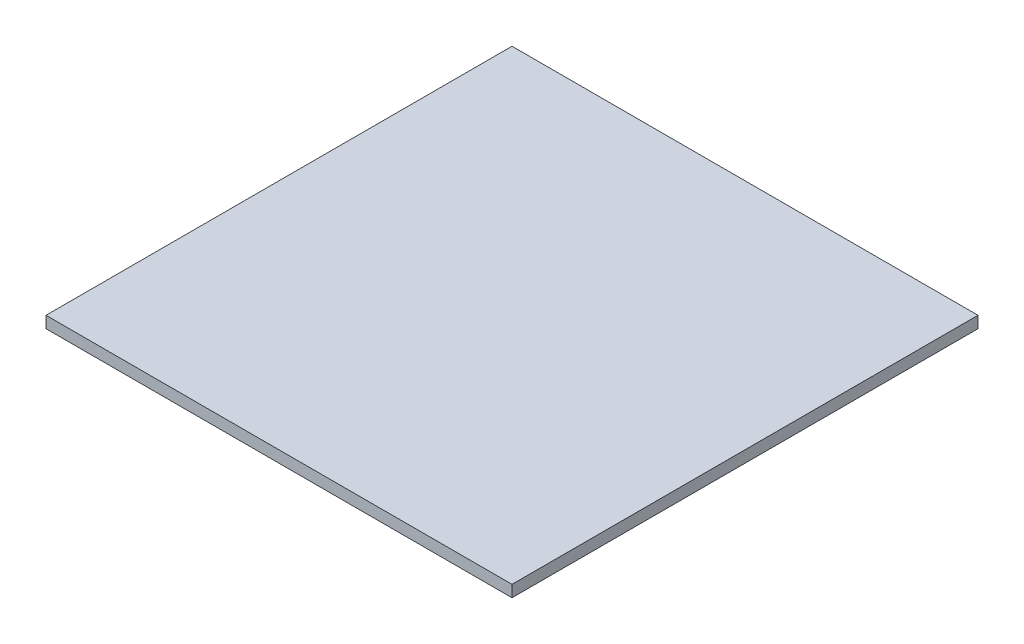
ISO-10303-21;
HEADER;
FILE_DESCRIPTION(('STEP AP214'),'2;1');
FILE_NAME('part.step','',(''),(''),'','','');
FILE_SCHEMA(('AUTOMOTIVE_DESIGN { 1 0 10303 214 1 1 1 1 }'));
ENDSEC;
DATA;
#1=APPLICATION_CONTEXT('core data for automotive mechanical design processes');
#2=APPLICATION_PROTOCOL_DEFINITION('international standard','automotive_design',2000,#1);
#3=PRODUCT_CONTEXT('',#1,'mechanical');
#4=PRODUCT('Part','Part','',(#3));
#5=PRODUCT_RELATED_PRODUCT_CATEGORY('part','',(#4));
#6=PRODUCT_DEFINITION_FORMATION('','',#4);
#7=PRODUCT_DEFINITION_CONTEXT('part definition',#1,'design');
#8=PRODUCT_DEFINITION('design','',#6,#7);
#9=PRODUCT_DEFINITION_SHAPE('','',#8);
#10=(LENGTH_UNIT() NAMED_UNIT(*) SI_UNIT(.MILLI.,.METRE.));
#11=(NAMED_UNIT(*) PLANE_ANGLE_UNIT() SI_UNIT($,.RADIAN.));
#12=(NAMED_UNIT(*) SI_UNIT($,.STERADIAN.) SOLID_ANGLE_UNIT());
#13=UNCERTAINTY_MEASURE_WITH_UNIT(LENGTH_MEASURE(1.E-05),#10,'distance_accuracy_value','');
#14=(GEOMETRIC_REPRESENTATION_CONTEXT(3) GLOBAL_UNCERTAINTY_ASSIGNED_CONTEXT((#13)) GLOBAL_UNIT_ASSIGNED_CONTEXT((#10,
#11,#12)) REPRESENTATION_CONTEXT('',''));
#15=CARTESIAN_POINT('',(0.,0.,0.));
#16=DIRECTION('',(0.,0.,1.));
#17=DIRECTION('',(1.,0.,0.));
#18=AXIS2_PLACEMENT_3D('',#15,#16,#17);
#19=CARTESIAN_POINT('',(0.,3.,0.));
#20=DIRECTION('',(1.,0.,0.));
#21=DIRECTION('',(0.,0.,-1.));
#22=AXIS2_PLACEMENT_3D('',#19,#20,#21);
#23=PLANE('',#22);
#24=DIRECTION('',(0.,0.,1.));
#25=VECTOR('',#24,1.);
#26=CARTESIAN_POINT('',(0.,0.,0.));
#27=LINE('',#26,#25);
#28=CARTESIAN_POINT('',(0.,0.,-120.));
#29=VERTEX_POINT('',#28);
#30=CARTESIAN_POINT('',(0.,0.,0.));
#31=VERTEX_POINT('',#30);
#32=EDGE_CURVE('E96',#29,#31,#27,.T.);
#33=ORIENTED_EDGE('',*,*,#32,.T.);
#34=DIRECTION('',(0.,-1.,0.));
#35=VECTOR('',#34,1.);
#36=CARTESIAN_POINT('',(0.,3.,0.));
#37=LINE('',#36,#35);
#38=CARTESIAN_POINT('',(0.,3.,0.));
#39=VERTEX_POINT('',#38);
#40=EDGE_CURVE('E11',#39,#31,#37,.T.);
#41=ORIENTED_EDGE('',*,*,#40,.F.);
#42=DIRECTION('',(0.,0.,1.));
#43=VECTOR('',#42,1.);
#44=CARTESIAN_POINT('',(0.,3.,0.));
#45=LINE('',#44,#43);
#46=CARTESIAN_POINT('',(0.,3.,-120.));
#47=VERTEX_POINT('',#46);
#48=EDGE_CURVE('E84',#47,#39,#45,.T.);
#49=ORIENTED_EDGE('',*,*,#48,.F.);
#50=DIRECTION('',(0.,-1.,0.));
#51=VECTOR('',#50,1.);
#52=CARTESIAN_POINT('',(0.,3.,-120.));
#53=LINE('',#52,#51);
#54=EDGE_CURVE('E92',#47,#29,#53,.T.);
#55=ORIENTED_EDGE('',*,*,#54,.T.);
#56=EDGE_LOOP('',(#33,#41,#49,#55));
#57=FACE_BOUND('',#56,.T.);
#58=ADVANCED_FACE('F33',(#57),#23,.F.);
#59=CARTESIAN_POINT('',(0.,3.,0.));
#60=DIRECTION('',(0.,0.,-1.));
#61=DIRECTION('',(-1.,0.,0.));
#62=AXIS2_PLACEMENT_3D('',#59,#60,#61);
#63=PLANE('',#62);
#64=DIRECTION('',(1.,0.,0.));
#65=VECTOR('',#64,1.);
#66=CARTESIAN_POINT('',(0.,0.,0.));
#67=LINE('',#66,#65);
#68=CARTESIAN_POINT('',(120.,0.,0.));
#69=VERTEX_POINT('',#68);
#70=EDGE_CURVE('E88',#31,#69,#67,.T.);
#71=ORIENTED_EDGE('',*,*,#70,.T.);
#72=DIRECTION('',(0.,-1.,0.));
#73=VECTOR('',#72,1.);
#74=CARTESIAN_POINT('',(120.,3.,0.));
#75=LINE('',#74,#73);
#76=CARTESIAN_POINT('',(120.,3.,0.));
#77=VERTEX_POINT('',#76);
#78=EDGE_CURVE('E41',#77,#69,#75,.T.);
#79=ORIENTED_EDGE('',*,*,#78,.F.);
#80=DIRECTION('',(1.,0.,0.));
#81=VECTOR('',#80,1.);
#82=CARTESIAN_POINT('',(0.,3.,0.));
#83=LINE('',#82,#81);
#84=EDGE_CURVE('E79',#39,#77,#83,.T.);
#85=ORIENTED_EDGE('',*,*,#84,.F.);
#86=ORIENTED_EDGE('',*,*,#40,.T.);
#87=EDGE_LOOP('',(#71,#79,#85,#86));
#88=FACE_BOUND('',#87,.T.);
#89=ADVANCED_FACE('F87',(#88),#63,.F.);
#90=CARTESIAN_POINT('',(120.,3.,0.));
#91=DIRECTION('',(-1.,0.,0.));
#92=DIRECTION('',(0.,0.,1.));
#93=AXIS2_PLACEMENT_3D('',#90,#91,#92);
#94=PLANE('',#93);
#95=DIRECTION('',(0.,0.,-1.));
#96=VECTOR('',#95,1.);
#97=CARTESIAN_POINT('',(120.,0.,0.));
#98=LINE('',#97,#96);
#99=CARTESIAN_POINT('',(120.,0.,-120.));
#100=VERTEX_POINT('',#99);
#101=EDGE_CURVE('E66',#69,#100,#98,.T.);
#102=ORIENTED_EDGE('',*,*,#101,.T.);
#103=DIRECTION('',(0.,-1.,0.));
#104=VECTOR('',#103,1.);
#105=CARTESIAN_POINT('',(120.,3.,-120.));
#106=LINE('',#105,#104);
#107=CARTESIAN_POINT('',(120.,3.,-120.));
#108=VERTEX_POINT('',#107);
#109=EDGE_CURVE('E89',#108,#100,#106,.T.);
#110=ORIENTED_EDGE('',*,*,#109,.F.);
#111=DIRECTION('',(0.,0.,-1.));
#112=VECTOR('',#111,1.);
#113=CARTESIAN_POINT('',(120.,3.,0.));
#114=LINE('',#113,#112);
#115=EDGE_CURVE('E82',#77,#108,#114,.T.);
#116=ORIENTED_EDGE('',*,*,#115,.F.);
#117=ORIENTED_EDGE('',*,*,#78,.T.);
#118=EDGE_LOOP('',(#102,#110,#116,#117));
#119=FACE_BOUND('',#118,.T.);
#120=ADVANCED_FACE('F90',(#119),#94,.F.);
#121=CARTESIAN_POINT('',(0.,3.,-120.));
#122=DIRECTION('',(0.,0.,1.));
#123=DIRECTION('',(1.,0.,0.));
#124=AXIS2_PLACEMENT_3D('',#121,#122,#123);
#125=PLANE('',#124);
#126=DIRECTION('',(-1.,0.,0.));
#127=VECTOR('',#126,1.);
#128=CARTESIAN_POINT('',(0.,0.,-120.));
#129=LINE('',#128,#127);
#130=EDGE_CURVE('E72',#100,#29,#129,.T.);
#131=ORIENTED_EDGE('',*,*,#130,.T.);
#132=ORIENTED_EDGE('',*,*,#54,.F.);
#133=DIRECTION('',(-1.,0.,0.));
#134=VECTOR('',#133,1.);
#135=CARTESIAN_POINT('',(0.,3.,-120.));
#136=LINE('',#135,#134);
#137=EDGE_CURVE('E49',#108,#47,#136,.T.);
#138=ORIENTED_EDGE('',*,*,#137,.F.);
#139=ORIENTED_EDGE('',*,*,#109,.T.);
#140=EDGE_LOOP('',(#131,#132,#138,#139));
#141=FACE_BOUND('',#140,.T.);
#142=ADVANCED_FACE('F103',(#141),#125,.F.);
#143=CARTESIAN_POINT('',(0.,3.,0.));
#144=DIRECTION('',(0.,-1.,0.));
#145=DIRECTION('',(0.,0.,-1.));
#146=AXIS2_PLACEMENT_3D('',#143,#144,#145);
#147=PLANE('',#146);
#148=ORIENTED_EDGE('',*,*,#48,.T.);
#149=ORIENTED_EDGE('',*,*,#84,.T.);
#150=ORIENTED_EDGE('',*,*,#115,.T.);
#151=ORIENTED_EDGE('',*,*,#137,.T.);
#152=EDGE_LOOP('',(#148,#149,#150,#151));
#153=FACE_BOUND('',#152,.T.);
#154=ADVANCED_FACE('F80',(#153),#147,.F.);
#155=CARTESIAN_POINT('',(0.,0.,0.));
#156=DIRECTION('',(0.,-1.,0.));
#157=DIRECTION('',(0.,0.,-1.));
#158=AXIS2_PLACEMENT_3D('',#155,#156,#157);
#159=PLANE('',#158);
#160=ORIENTED_EDGE('',*,*,#32,.F.);
#161=ORIENTED_EDGE('',*,*,#130,.F.);
#162=ORIENTED_EDGE('',*,*,#101,.F.);
#163=ORIENTED_EDGE('',*,*,#70,.F.);
#164=EDGE_LOOP('',(#160,#161,#162,#163));
#165=FACE_BOUND('',#164,.T.);
#166=ADVANCED_FACE('F106',(#165),#159,.T.);
#167=CLOSED_SHELL('',(#58,#89,#120,#142,#154,#166));
#168=MANIFOLD_SOLID_BREP('B2',#167);
#169=ADVANCED_BREP_SHAPE_REPRESENTATION('',(#18,#168),#14);
#170=SHAPE_DEFINITION_REPRESENTATION(#9,#169);
ENDSEC;
END-ISO-10303-21;
